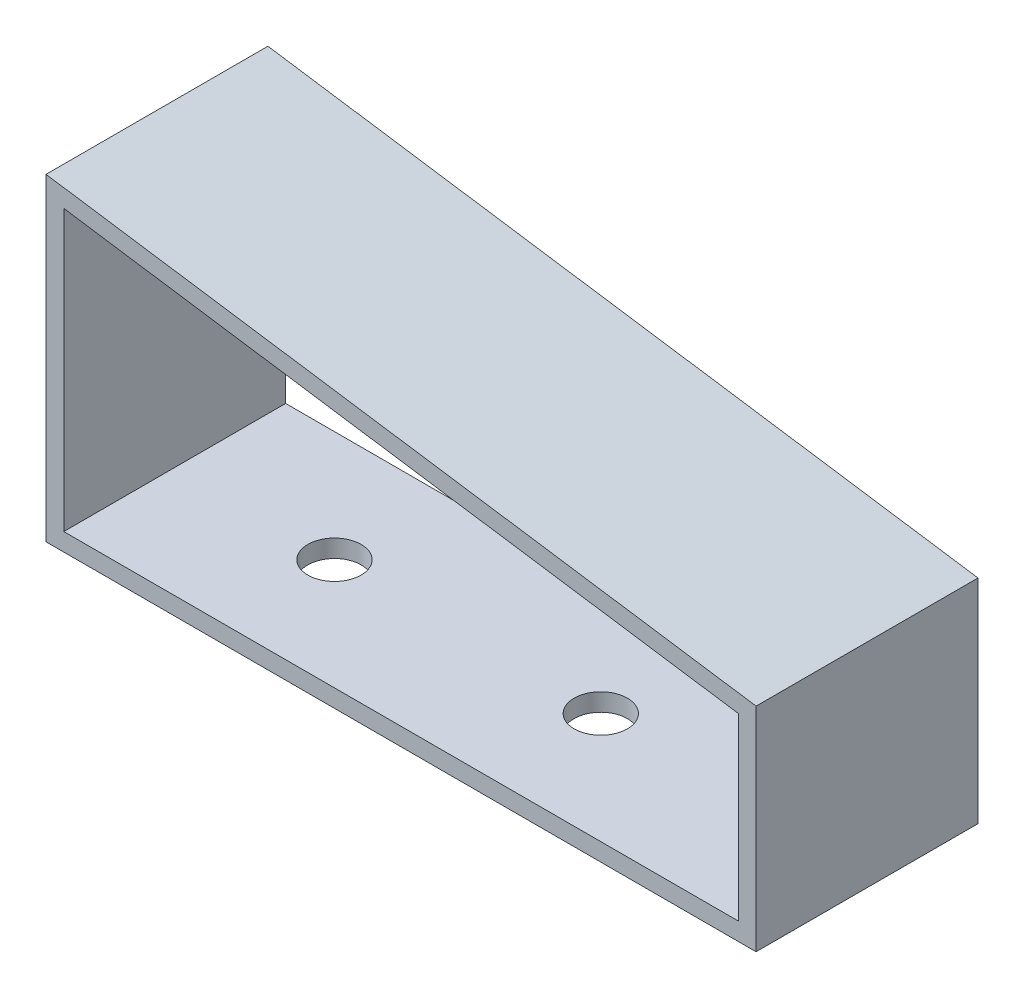
ISO-10303-21;
HEADER;
FILE_DESCRIPTION(('STEP AP214'),'2;1');
FILE_NAME('part.step','',(''),(''),'','','');
FILE_SCHEMA(('AUTOMOTIVE_DESIGN { 1 0 10303 214 1 1 1 1 }'));
ENDSEC;
DATA;
#1=APPLICATION_CONTEXT('core data for automotive mechanical design processes');
#2=APPLICATION_PROTOCOL_DEFINITION('international standard','automotive_design',2000,#1);
#3=PRODUCT_CONTEXT('',#1,'mechanical');
#4=PRODUCT('Part','Part','',(#3));
#5=PRODUCT_RELATED_PRODUCT_CATEGORY('part','',(#4));
#6=PRODUCT_DEFINITION_FORMATION('','',#4);
#7=PRODUCT_DEFINITION_CONTEXT('part definition',#1,'design');
#8=PRODUCT_DEFINITION('design','',#6,#7);
#9=PRODUCT_DEFINITION_SHAPE('','',#8);
#10=(LENGTH_UNIT() NAMED_UNIT(*) SI_UNIT(.MILLI.,.METRE.));
#11=(NAMED_UNIT(*) PLANE_ANGLE_UNIT() SI_UNIT($,.RADIAN.));
#12=(NAMED_UNIT(*) SI_UNIT($,.STERADIAN.) SOLID_ANGLE_UNIT());
#13=UNCERTAINTY_MEASURE_WITH_UNIT(LENGTH_MEASURE(1.E-05),#10,'distance_accuracy_value','');
#14=(GEOMETRIC_REPRESENTATION_CONTEXT(3) GLOBAL_UNCERTAINTY_ASSIGNED_CONTEXT((#13)) GLOBAL_UNIT_ASSIGNED_CONTEXT((#10,
#11,#12)) REPRESENTATION_CONTEXT('',''));
#15=CARTESIAN_POINT('',(0.,0.,0.));
#16=DIRECTION('',(0.,0.,1.));
#17=DIRECTION('',(1.,0.,0.));
#18=AXIS2_PLACEMENT_3D('',#15,#16,#17);
#19=CARTESIAN_POINT('',(0.,0.,25.));
#20=DIRECTION('',(0.,0.,-1.));
#21=DIRECTION('',(-1.,0.,0.));
#22=AXIS2_PLACEMENT_3D('',#19,#20,#21);
#23=PLANE('',#22);
#24=DIRECTION('',(0.,1.,0.));
#25=VECTOR('',#24,1.);
#26=CARTESIAN_POINT('',(80.,0.,25.));
#27=LINE('',#26,#25);
#28=CARTESIAN_POINT('',(80.,0.,25.));
#29=VERTEX_POINT('',#28);
#30=CARTESIAN_POINT('',(80.,23.9705028956908,25.));
#31=VERTEX_POINT('',#30);
#32=EDGE_CURVE('E137',#29,#31,#27,.T.);
#33=ORIENTED_EDGE('',*,*,#32,.T.);
#34=DIRECTION('',(-0.989147984049541,0.146922651931994,0.));
#35=VECTOR('',#34,1.);
#36=CARTESIAN_POINT('',(80.,23.9705028956908,25.));
#37=LINE('',#36,#35);
#38=CARTESIAN_POINT('',(0.,35.8532669958002,25.));
#39=VERTEX_POINT('',#38);
#40=EDGE_CURVE('E140',#31,#39,#37,.T.);
#41=ORIENTED_EDGE('',*,*,#40,.T.);
#42=DIRECTION('',(0.,-1.,0.));
#43=VECTOR('',#42,1.);
#44=CARTESIAN_POINT('',(0.,35.8532669958002,25.));
#45=LINE('',#44,#43);
#46=CARTESIAN_POINT('',(0.,0.,25.));
#47=VERTEX_POINT('',#46);
#48=EDGE_CURVE('E143',#39,#47,#45,.T.);
#49=ORIENTED_EDGE('',*,*,#48,.T.);
#50=DIRECTION('',(1.,0.,0.));
#51=VECTOR('',#50,1.);
#52=CARTESIAN_POINT('',(0.,0.,25.));
#53=LINE('',#52,#51);
#54=EDGE_CURVE('E145',#47,#29,#53,.T.);
#55=ORIENTED_EDGE('',*,*,#54,.T.);
#56=EDGE_LOOP('',(#33,#41,#49,#55));
#57=FACE_BOUND('',#56,.T.);
#58=DIRECTION('',(-0.98914798404954,0.146922651931994,0.));
#59=VECTOR('',#58,1.);
#60=CARTESIAN_POINT('',(78.,22.2456298497476,25.));
#61=LINE('',#60,#59);
#62=CARTESIAN_POINT('',(78.,22.2456298497476,25.));
#63=VERTEX_POINT('',#62);
#64=CARTESIAN_POINT('',(2.,33.5342557448516,25.));
#65=VERTEX_POINT('',#64);
#66=EDGE_CURVE('E100',#63,#65,#61,.T.);
#67=ORIENTED_EDGE('',*,*,#66,.F.);
#68=DIRECTION('',(0.,1.,0.));
#69=VECTOR('',#68,1.);
#70=CARTESIAN_POINT('',(78.,2.00000000000002,25.));
#71=LINE('',#70,#69);
#72=CARTESIAN_POINT('',(78.,2.00000000000002,25.));
#73=VERTEX_POINT('',#72);
#74=EDGE_CURVE('E122',#73,#63,#71,.T.);
#75=ORIENTED_EDGE('',*,*,#74,.F.);
#76=DIRECTION('',(1.,0.,0.));
#77=VECTOR('',#76,1.);
#78=CARTESIAN_POINT('',(2.,2.,25.));
#79=LINE('',#78,#77);
#80=CARTESIAN_POINT('',(2.,2.,25.));
#81=VERTEX_POINT('',#80);
#82=EDGE_CURVE('E120',#81,#73,#79,.T.);
#83=ORIENTED_EDGE('',*,*,#82,.F.);
#84=DIRECTION('',(0.,-1.,0.));
#85=VECTOR('',#84,1.);
#86=CARTESIAN_POINT('',(2.,33.5342557448516,25.));
#87=LINE('',#86,#85);
#88=EDGE_CURVE('E108',#65,#81,#87,.T.);
#89=ORIENTED_EDGE('',*,*,#88,.F.);
#90=EDGE_LOOP('',(#67,#75,#83,#89));
#91=FACE_BOUND('',#90,.T.);
#92=ADVANCED_FACE('F33',(#57,#91),#23,.F.);
#93=CARTESIAN_POINT('',(0.,0.,0.));
#94=DIRECTION('',(0.,0.,-1.));
#95=DIRECTION('',(-1.,0.,0.));
#96=AXIS2_PLACEMENT_3D('',#93,#94,#95);
#97=PLANE('',#96);
#98=DIRECTION('',(0.,1.,0.));
#99=VECTOR('',#98,1.);
#100=CARTESIAN_POINT('',(80.,0.,0.));
#101=LINE('',#100,#99);
#102=CARTESIAN_POINT('',(80.,0.,0.));
#103=VERTEX_POINT('',#102);
#104=CARTESIAN_POINT('',(80.,23.9705028956908,0.));
#105=VERTEX_POINT('',#104);
#106=EDGE_CURVE('E116',#103,#105,#101,.T.);
#107=ORIENTED_EDGE('',*,*,#106,.F.);
#108=DIRECTION('',(1.,0.,0.));
#109=VECTOR('',#108,1.);
#110=CARTESIAN_POINT('',(0.,0.,0.));
#111=LINE('',#110,#109);
#112=CARTESIAN_POINT('',(0.,0.,0.));
#113=VERTEX_POINT('',#112);
#114=EDGE_CURVE('E141',#113,#103,#111,.T.);
#115=ORIENTED_EDGE('',*,*,#114,.F.);
#116=DIRECTION('',(0.,-1.,0.));
#117=VECTOR('',#116,1.);
#118=CARTESIAN_POINT('',(0.,35.8532669958002,0.));
#119=LINE('',#118,#117);
#120=CARTESIAN_POINT('',(0.,35.8532669958002,0.));
#121=VERTEX_POINT('',#120);
#122=EDGE_CURVE('E152',#121,#113,#119,.T.);
#123=ORIENTED_EDGE('',*,*,#122,.F.);
#124=DIRECTION('',(-0.989147984049541,0.146922651931994,0.));
#125=VECTOR('',#124,1.);
#126=CARTESIAN_POINT('',(80.,23.9705028956908,0.));
#127=LINE('',#126,#125);
#128=EDGE_CURVE('E150',#105,#121,#127,.T.);
#129=ORIENTED_EDGE('',*,*,#128,.F.);
#130=EDGE_LOOP('',(#107,#115,#123,#129));
#131=FACE_BOUND('',#130,.T.);
#132=DIRECTION('',(0.,1.,0.));
#133=VECTOR('',#132,1.);
#134=CARTESIAN_POINT('',(78.,2.00000000000002,0.));
#135=LINE('',#134,#133);
#136=CARTESIAN_POINT('',(78.,2.00000000000002,0.));
#137=VERTEX_POINT('',#136);
#138=CARTESIAN_POINT('',(78.,22.2456298497476,0.));
#139=VERTEX_POINT('',#138);
#140=EDGE_CURVE('E109',#137,#139,#135,.T.);
#141=ORIENTED_EDGE('',*,*,#140,.T.);
#142=DIRECTION('',(-0.98914798404954,0.146922651931994,0.));
#143=VECTOR('',#142,1.);
#144=CARTESIAN_POINT('',(78.,22.2456298497476,0.));
#145=LINE('',#144,#143);
#146=CARTESIAN_POINT('',(2.,33.5342557448516,0.));
#147=VERTEX_POINT('',#146);
#148=EDGE_CURVE('E58',#139,#147,#145,.T.);
#149=ORIENTED_EDGE('',*,*,#148,.T.);
#150=DIRECTION('',(0.,-1.,0.));
#151=VECTOR('',#150,1.);
#152=CARTESIAN_POINT('',(2.,33.5342557448516,0.));
#153=LINE('',#152,#151);
#154=CARTESIAN_POINT('',(2.,2.,0.));
#155=VERTEX_POINT('',#154);
#156=EDGE_CURVE('E115',#147,#155,#153,.T.);
#157=ORIENTED_EDGE('',*,*,#156,.T.);
#158=DIRECTION('',(1.,0.,0.));
#159=VECTOR('',#158,1.);
#160=CARTESIAN_POINT('',(2.,2.,0.));
#161=LINE('',#160,#159);
#162=EDGE_CURVE('E129',#155,#137,#161,.T.);
#163=ORIENTED_EDGE('',*,*,#162,.T.);
#164=EDGE_LOOP('',(#141,#149,#157,#163));
#165=FACE_BOUND('',#164,.T.);
#166=ADVANCED_FACE('F193',(#131,#165),#97,.T.);
#167=CARTESIAN_POINT('',(80.,0.,25.));
#168=DIRECTION('',(-1.,0.,0.));
#169=DIRECTION('',(0.,0.,1.));
#170=AXIS2_PLACEMENT_3D('',#167,#168,#169);
#171=PLANE('',#170);
#172=ORIENTED_EDGE('',*,*,#106,.T.);
#173=DIRECTION('',(0.,0.,-1.));
#174=VECTOR('',#173,1.);
#175=CARTESIAN_POINT('',(80.,23.9705028956908,25.));
#176=LINE('',#175,#174);
#177=EDGE_CURVE('E11',#31,#105,#176,.T.);
#178=ORIENTED_EDGE('',*,*,#177,.F.);
#179=ORIENTED_EDGE('',*,*,#32,.F.);
#180=DIRECTION('',(0.,0.,-1.));
#181=VECTOR('',#180,1.);
#182=CARTESIAN_POINT('',(80.,0.,25.));
#183=LINE('',#182,#181);
#184=EDGE_CURVE('E147',#29,#103,#183,.T.);
#185=ORIENTED_EDGE('',*,*,#184,.T.);
#186=EDGE_LOOP('',(#172,#178,#179,#185));
#187=FACE_BOUND('',#186,.T.);
#188=ADVANCED_FACE('F35',(#187),#171,.F.);
#189=CARTESIAN_POINT('',(80.,23.9705028956908,25.));
#190=DIRECTION('',(-0.146922651931994,-0.989147984049541,0.));
#191=DIRECTION('',(0.989147984049541,-0.146922651931994,0.));
#192=AXIS2_PLACEMENT_3D('',#189,#190,#191);
#193=PLANE('',#192);
#194=ORIENTED_EDGE('',*,*,#128,.T.);
#195=DIRECTION('',(0.,0.,-1.));
#196=VECTOR('',#195,1.);
#197=CARTESIAN_POINT('',(0.,35.8532669958002,25.));
#198=LINE('',#197,#196);
#199=EDGE_CURVE('E42',#39,#121,#198,.T.);
#200=ORIENTED_EDGE('',*,*,#199,.F.);
#201=ORIENTED_EDGE('',*,*,#40,.F.);
#202=ORIENTED_EDGE('',*,*,#177,.T.);
#203=EDGE_LOOP('',(#194,#200,#201,#202));
#204=FACE_BOUND('',#203,.T.);
#205=ADVANCED_FACE('F197',(#204),#193,.F.);
#206=CARTESIAN_POINT('',(0.,35.8532669958002,25.));
#207=DIRECTION('',(1.,0.,0.));
#208=DIRECTION('',(0.,0.,-1.));
#209=AXIS2_PLACEMENT_3D('',#206,#207,#208);
#210=PLANE('',#209);
#211=ORIENTED_EDGE('',*,*,#122,.T.);
#212=DIRECTION('',(0.,0.,-1.));
#213=VECTOR('',#212,1.);
#214=CARTESIAN_POINT('',(0.,0.,25.));
#215=LINE('',#214,#213);
#216=EDGE_CURVE('E157',#47,#113,#215,.T.);
#217=ORIENTED_EDGE('',*,*,#216,.F.);
#218=ORIENTED_EDGE('',*,*,#48,.F.);
#219=ORIENTED_EDGE('',*,*,#199,.T.);
#220=EDGE_LOOP('',(#211,#217,#218,#219));
#221=FACE_BOUND('',#220,.T.);
#222=ADVANCED_FACE('F180',(#221),#210,.F.);
#223=CARTESIAN_POINT('',(0.,0.,25.));
#224=DIRECTION('',(0.,1.,0.));
#225=DIRECTION('',(-1.,0.,0.));
#226=AXIS2_PLACEMENT_3D('',#223,#224,#225);
#227=PLANE('',#226);
#228=CARTESIAN_POINT('',(20.,0.,12.5));
#229=DIRECTION('',(0.,-1.,0.));
#230=DIRECTION('',(1.,0.,0.));
#231=AXIS2_PLACEMENT_3D('',#228,#229,#230);
#232=CIRCLE('',#231,3.);
#233=CARTESIAN_POINT('',(23.,0.,12.5));
#234=VERTEX_POINT('',#233);
#235=EDGE_CURVE('E163',#234,#234,#232,.T.);
#236=ORIENTED_EDGE('',*,*,#235,.F.);
#237=EDGE_LOOP('',(#236));
#238=FACE_BOUND('',#237,.T.);
#239=CARTESIAN_POINT('',(50.,0.,12.5));
#240=DIRECTION('',(0.,-1.,0.));
#241=DIRECTION('',(1.,0.,0.));
#242=AXIS2_PLACEMENT_3D('',#239,#240,#241);
#243=CIRCLE('',#242,3.);
#244=CARTESIAN_POINT('',(53.,0.,12.5));
#245=VERTEX_POINT('',#244);
#246=EDGE_CURVE('E168',#245,#245,#243,.T.);
#247=ORIENTED_EDGE('',*,*,#246,.F.);
#248=EDGE_LOOP('',(#247));
#249=FACE_BOUND('',#248,.T.);
#250=ORIENTED_EDGE('',*,*,#114,.T.);
#251=ORIENTED_EDGE('',*,*,#184,.F.);
#252=ORIENTED_EDGE('',*,*,#54,.F.);
#253=ORIENTED_EDGE('',*,*,#216,.T.);
#254=EDGE_LOOP('',(#250,#251,#252,#253));
#255=FACE_BOUND('',#254,.T.);
#256=ADVANCED_FACE('F177',(#238,#249,#255),#227,.F.);
#257=CARTESIAN_POINT('',(78.,22.2456298497476,25.));
#258=DIRECTION('',(-0.146922651931994,-0.989147984049541,0.));
#259=DIRECTION('',(0.989147984049541,-0.146922651931994,0.));
#260=AXIS2_PLACEMENT_3D('',#257,#258,#259);
#261=PLANE('',#260);
#262=ORIENTED_EDGE('',*,*,#148,.F.);
#263=DIRECTION('',(0.,0.,-1.));
#264=VECTOR('',#263,1.);
#265=CARTESIAN_POINT('',(78.,22.2456298497476,25.));
#266=LINE('',#265,#264);
#267=EDGE_CURVE('E104',#63,#139,#266,.T.);
#268=ORIENTED_EDGE('',*,*,#267,.F.);
#269=ORIENTED_EDGE('',*,*,#66,.T.);
#270=DIRECTION('',(0.,0.,-1.));
#271=VECTOR('',#270,1.);
#272=CARTESIAN_POINT('',(2.,33.5342557448516,25.));
#273=LINE('',#272,#271);
#274=EDGE_CURVE('E103',#65,#147,#273,.T.);
#275=ORIENTED_EDGE('',*,*,#274,.T.);
#276=EDGE_LOOP('',(#262,#268,#269,#275));
#277=FACE_BOUND('',#276,.T.);
#278=ADVANCED_FACE('F102',(#277),#261,.T.);
#279=CARTESIAN_POINT('',(2.,33.5342557448516,25.));
#280=DIRECTION('',(1.,0.,0.));
#281=DIRECTION('',(0.,1.,0.));
#282=AXIS2_PLACEMENT_3D('',#279,#280,#281);
#283=PLANE('',#282);
#284=ORIENTED_EDGE('',*,*,#156,.F.);
#285=ORIENTED_EDGE('',*,*,#274,.F.);
#286=ORIENTED_EDGE('',*,*,#88,.T.);
#287=DIRECTION('',(0.,0.,-1.));
#288=VECTOR('',#287,1.);
#289=CARTESIAN_POINT('',(2.,2.,25.));
#290=LINE('',#289,#288);
#291=EDGE_CURVE('E117',#81,#155,#290,.T.);
#292=ORIENTED_EDGE('',*,*,#291,.T.);
#293=EDGE_LOOP('',(#284,#285,#286,#292));
#294=FACE_BOUND('',#293,.T.);
#295=ADVANCED_FACE('F112',(#294),#283,.T.);
#296=CARTESIAN_POINT('',(2.,2.,25.));
#297=DIRECTION('',(0.,1.,0.));
#298=DIRECTION('',(-1.,0.,0.));
#299=AXIS2_PLACEMENT_3D('',#296,#297,#298);
#300=PLANE('',#299);
#301=CARTESIAN_POINT('',(20.,2.,12.5));
#302=DIRECTION('',(0.,1.,0.));
#303=DIRECTION('',(-1.,0.,0.));
#304=AXIS2_PLACEMENT_3D('',#301,#302,#303);
#305=CIRCLE('',#304,3.);
#306=CARTESIAN_POINT('',(17.,2.,12.5));
#307=VERTEX_POINT('',#306);
#308=EDGE_CURVE('E37',#307,#307,#305,.T.);
#309=ORIENTED_EDGE('',*,*,#308,.F.);
#310=EDGE_LOOP('',(#309));
#311=FACE_BOUND('',#310,.T.);
#312=CARTESIAN_POINT('',(50.,2.00000000000001,12.5));
#313=DIRECTION('',(0.,1.,0.));
#314=DIRECTION('',(-1.,0.,0.));
#315=AXIS2_PLACEMENT_3D('',#312,#313,#314);
#316=CIRCLE('',#315,3.);
#317=CARTESIAN_POINT('',(47.,2.00000000000001,12.5));
#318=VERTEX_POINT('',#317);
#319=EDGE_CURVE('E161',#318,#318,#316,.T.);
#320=ORIENTED_EDGE('',*,*,#319,.F.);
#321=EDGE_LOOP('',(#320));
#322=FACE_BOUND('',#321,.T.);
#323=ORIENTED_EDGE('',*,*,#162,.F.);
#324=ORIENTED_EDGE('',*,*,#291,.F.);
#325=ORIENTED_EDGE('',*,*,#82,.T.);
#326=DIRECTION('',(0.,0.,-1.));
#327=VECTOR('',#326,1.);
#328=CARTESIAN_POINT('',(78.,2.00000000000002,25.));
#329=LINE('',#328,#327);
#330=EDGE_CURVE('E50',#73,#137,#329,.T.);
#331=ORIENTED_EDGE('',*,*,#330,.T.);
#332=EDGE_LOOP('',(#323,#324,#325,#331));
#333=FACE_BOUND('',#332,.T.);
#334=ADVANCED_FACE('F218',(#311,#322,#333),#300,.T.);
#335=CARTESIAN_POINT('',(78.,2.00000000000002,25.));
#336=DIRECTION('',(-1.,0.,0.));
#337=DIRECTION('',(0.,0.,1.));
#338=AXIS2_PLACEMENT_3D('',#335,#336,#337);
#339=PLANE('',#338);
#340=ORIENTED_EDGE('',*,*,#140,.F.);
#341=ORIENTED_EDGE('',*,*,#330,.F.);
#342=ORIENTED_EDGE('',*,*,#74,.T.);
#343=ORIENTED_EDGE('',*,*,#267,.T.);
#344=EDGE_LOOP('',(#340,#341,#342,#343));
#345=FACE_BOUND('',#344,.T.);
#346=ADVANCED_FACE('F221',(#345),#339,.T.);
#347=CARTESIAN_POINT('',(50.,17.,12.5));
#348=DIRECTION('',(0.,-1.,0.));
#349=DIRECTION('',(1.,0.,0.));
#350=AXIS2_PLACEMENT_3D('',#347,#348,#349);
#351=CYLINDRICAL_SURFACE('',#350,3.);
#352=ORIENTED_EDGE('',*,*,#319,.T.);
#353=EDGE_LOOP('',(#352));
#354=FACE_BOUND('',#353,.T.);
#355=ORIENTED_EDGE('',*,*,#246,.T.);
#356=EDGE_LOOP('',(#355));
#357=FACE_BOUND('',#356,.T.);
#358=ADVANCED_FACE('F175',(#354,#357),#351,.F.);
#359=CARTESIAN_POINT('',(20.,17.,12.5));
#360=DIRECTION('',(0.,-1.,0.));
#361=DIRECTION('',(1.,0.,0.));
#362=AXIS2_PLACEMENT_3D('',#359,#360,#361);
#363=CYLINDRICAL_SURFACE('',#362,3.);
#364=ORIENTED_EDGE('',*,*,#308,.T.);
#365=EDGE_LOOP('',(#364));
#366=FACE_BOUND('',#365,.T.);
#367=ORIENTED_EDGE('',*,*,#235,.T.);
#368=EDGE_LOOP('',(#367));
#369=FACE_BOUND('',#368,.T.);
#370=ADVANCED_FACE('F227',(#366,#369),#363,.F.);
#371=CLOSED_SHELL('',(#92,#166,#188,#205,#222,#256,#278,#295,#334,#346,#358,#370));
#372=MANIFOLD_SOLID_BREP('B2',#371);
#373=ADVANCED_BREP_SHAPE_REPRESENTATION('',(#18,#372),#14);
#374=SHAPE_DEFINITION_REPRESENTATION(#9,#373);
ENDSEC;
END-ISO-10303-21;
